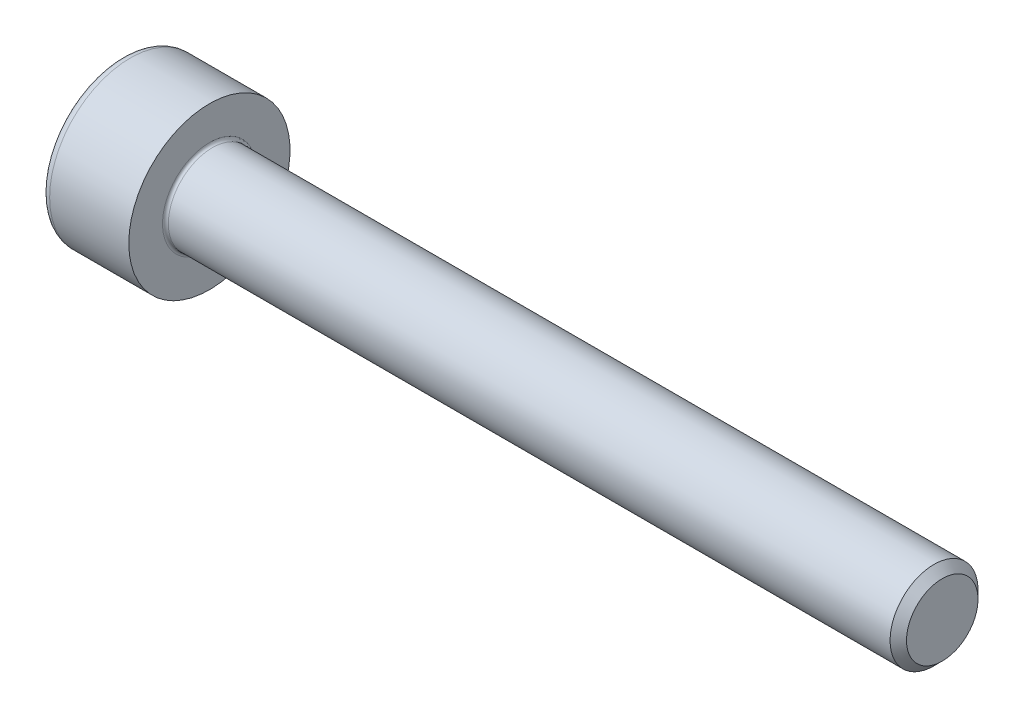
ISO-10303-21;
HEADER;
FILE_DESCRIPTION(('STEP AP214'),'2;1');
FILE_NAME('part.step','',(''),(''),'','','');
FILE_SCHEMA(('AUTOMOTIVE_DESIGN { 1 0 10303 214 1 1 1 1 }'));
ENDSEC;
DATA;
#1=APPLICATION_CONTEXT('core data for automotive mechanical design processes');
#2=APPLICATION_PROTOCOL_DEFINITION('international standard','automotive_design',2000,#1);
#3=PRODUCT_CONTEXT('',#1,'mechanical');
#4=PRODUCT('Part','Part','',(#3));
#5=PRODUCT_RELATED_PRODUCT_CATEGORY('part','',(#4));
#6=PRODUCT_DEFINITION_FORMATION('','',#4);
#7=PRODUCT_DEFINITION_CONTEXT('part definition',#1,'design');
#8=PRODUCT_DEFINITION('design','',#6,#7);
#9=PRODUCT_DEFINITION_SHAPE('','',#8);
#10=(LENGTH_UNIT() NAMED_UNIT(*) SI_UNIT(.MILLI.,.METRE.));
#11=(NAMED_UNIT(*) PLANE_ANGLE_UNIT() SI_UNIT($,.RADIAN.));
#12=(NAMED_UNIT(*) SI_UNIT($,.STERADIAN.) SOLID_ANGLE_UNIT());
#13=UNCERTAINTY_MEASURE_WITH_UNIT(LENGTH_MEASURE(1.E-05),#10,'distance_accuracy_value','');
#14=(GEOMETRIC_REPRESENTATION_CONTEXT(3) GLOBAL_UNCERTAINTY_ASSIGNED_CONTEXT((#13)) GLOBAL_UNIT_ASSIGNED_CONTEXT((#10,
#11,#12)) REPRESENTATION_CONTEXT('',''));
#15=CARTESIAN_POINT('',(0.,0.,0.));
#16=DIRECTION('',(0.,0.,1.));
#17=DIRECTION('',(1.,0.,0.));
#18=AXIS2_PLACEMENT_3D('',#15,#16,#17);
#19=CARTESIAN_POINT('',(0.,0.,0.));
#20=DIRECTION('',(-1.,0.,0.));
#21=DIRECTION('',(0.,0.,1.));
#22=AXIS2_PLACEMENT_3D('',#19,#20,#21);
#23=PLANE('',#22);
#24=DIRECTION('',(0.,-0.499999999999999,0.866025403784439));
#25=VECTOR('',#24,1.);
#26=CARTESIAN_POINT('',(0.,1.45492267835785,0.));
#27=LINE('',#26,#25);
#28=CARTESIAN_POINT('',(0.,1.45492267835785,0.));
#29=VERTEX_POINT('',#28);
#30=CARTESIAN_POINT('',(0.,0.727461339178922,1.26));
#31=VERTEX_POINT('',#30);
#32=EDGE_CURVE('E260',#29,#31,#27,.T.);
#33=ORIENTED_EDGE('',*,*,#32,.T.);
#34=DIRECTION('',(0.,1.,0.));
#35=VECTOR('',#34,1.);
#36=CARTESIAN_POINT('',(0.,-0.727461339178934,1.26));
#37=LINE('',#36,#35);
#38=CARTESIAN_POINT('',(0.,-0.727461339178934,1.26));
#39=VERTEX_POINT('',#38);
#40=EDGE_CURVE('E132',#39,#31,#37,.T.);
#41=ORIENTED_EDGE('',*,*,#40,.F.);
#42=DIRECTION('',(0.,-0.500000000000001,-0.866025403784438));
#43=VECTOR('',#42,1.);
#44=CARTESIAN_POINT('',(0.,-0.727461339178934,1.26));
#45=LINE('',#44,#43);
#46=CARTESIAN_POINT('',(0.,-1.45492267835786,0.));
#47=VERTEX_POINT('',#46);
#48=EDGE_CURVE('E263',#39,#47,#45,.T.);
#49=ORIENTED_EDGE('',*,*,#48,.T.);
#50=DIRECTION('',(0.,0.499999999999998,-0.86602540378444));
#51=VECTOR('',#50,1.);
#52=CARTESIAN_POINT('',(0.,-1.45492267835786,0.));
#53=LINE('',#52,#51);
#54=CARTESIAN_POINT('',(0.,-0.727461339178938,-1.26));
#55=VERTEX_POINT('',#54);
#56=EDGE_CURVE('E266',#47,#55,#53,.T.);
#57=ORIENTED_EDGE('',*,*,#56,.T.);
#58=DIRECTION('',(0.,-1.,0.));
#59=VECTOR('',#58,1.);
#60=CARTESIAN_POINT('',(0.,0.727461339178918,-1.26));
#61=LINE('',#60,#59);
#62=CARTESIAN_POINT('',(0.,0.727461339178918,-1.26));
#63=VERTEX_POINT('',#62);
#64=EDGE_CURVE('E269',#63,#55,#61,.T.);
#65=ORIENTED_EDGE('',*,*,#64,.F.);
#66=DIRECTION('',(0.,-0.500000000000001,-0.866025403784438));
#67=VECTOR('',#66,1.);
#68=CARTESIAN_POINT('',(0.,1.45492267835785,0.));
#69=LINE('',#68,#67);
#70=EDGE_CURVE('E127',#29,#63,#69,.T.);
#71=ORIENTED_EDGE('',*,*,#70,.F.);
#72=EDGE_LOOP('',(#33,#41,#49,#57,#65,#71));
#73=FACE_BOUND('',#72,.T.);
#74=CARTESIAN_POINT('',(0.,0.,0.));
#75=DIRECTION('',(-1.,0.,0.));
#76=DIRECTION('',(0.,0.,1.));
#77=AXIS2_PLACEMENT_3D('',#74,#75,#76);
#78=CIRCLE('',#77,2.45);
#79=CARTESIAN_POINT('',(0.,0.,2.45));
#80=VERTEX_POINT('',#79);
#81=EDGE_CURVE('E44',#80,#80,#78,.T.);
#82=ORIENTED_EDGE('',*,*,#81,.T.);
#83=EDGE_LOOP('',(#82));
#84=FACE_BOUND('',#83,.T.);
#85=ADVANCED_FACE('F36',(#73,#84),#23,.T.);
#86=CARTESIAN_POINT('',(-31.75,0.,0.));
#87=DIRECTION('',(-1.,0.,0.));
#88=DIRECTION('',(0.,0.,1.));
#89=AXIS2_PLACEMENT_3D('',#86,#87,#88);
#90=CYLINDRICAL_SURFACE('',#89,2.75);
#91=CARTESIAN_POINT('',(0.300000000000002,0.,0.));
#92=DIRECTION('',(-1.,0.,0.));
#93=DIRECTION('',(0.,0.,1.));
#94=AXIS2_PLACEMENT_3D('',#91,#92,#93);
#95=CIRCLE('',#94,2.75);
#96=CARTESIAN_POINT('',(0.300000000000002,0.,2.75));
#97=VERTEX_POINT('',#96);
#98=EDGE_CURVE('E11',#97,#97,#95,.F.);
#99=ORIENTED_EDGE('',*,*,#98,.T.);
#100=EDGE_LOOP('',(#99));
#101=FACE_BOUND('',#100,.T.);
#102=CARTESIAN_POINT('',(3.,0.,0.));
#103=DIRECTION('',(-1.,0.,0.));
#104=DIRECTION('',(0.,0.,1.));
#105=AXIS2_PLACEMENT_3D('',#102,#103,#104);
#106=CIRCLE('',#105,2.75);
#107=CARTESIAN_POINT('',(3.,0.,2.75));
#108=VERTEX_POINT('',#107);
#109=EDGE_CURVE('E150',#108,#108,#106,.T.);
#110=ORIENTED_EDGE('',*,*,#109,.T.);
#111=EDGE_LOOP('',(#110));
#112=FACE_BOUND('',#111,.T.);
#113=ADVANCED_FACE('F174',(#101,#112),#90,.T.);
#114=CARTESIAN_POINT('',(3.,2.75,0.));
#115=DIRECTION('',(1.,0.,0.));
#116=DIRECTION('',(0.,0.,-1.));
#117=AXIS2_PLACEMENT_3D('',#114,#115,#116);
#118=PLANE('',#117);
#119=CARTESIAN_POINT('',(3.,0.,0.));
#120=DIRECTION('',(1.,0.,0.));
#121=DIRECTION('',(0.,0.,-1.));
#122=AXIS2_PLACEMENT_3D('',#119,#120,#121);
#123=CIRCLE('',#122,1.59999999999995);
#124=CARTESIAN_POINT('',(3.,0.,-1.59999999999995));
#125=VERTEX_POINT('',#124);
#126=EDGE_CURVE('E153',#125,#125,#123,.F.);
#127=ORIENTED_EDGE('',*,*,#126,.T.);
#128=EDGE_LOOP('',(#127));
#129=FACE_BOUND('',#128,.T.);
#130=ORIENTED_EDGE('',*,*,#109,.F.);
#131=EDGE_LOOP('',(#130));
#132=FACE_BOUND('',#131,.T.);
#133=ADVANCED_FACE('F180',(#129,#132),#118,.T.);
#134=CARTESIAN_POINT('',(-31.75,0.,0.));
#135=DIRECTION('',(-1.,0.,0.));
#136=DIRECTION('',(0.,0.,1.));
#137=AXIS2_PLACEMENT_3D('',#134,#135,#136);
#138=CYLINDRICAL_SURFACE('',#137,1.49999999999995);
#139=CARTESIAN_POINT('',(3.1,0.,0.));
#140=DIRECTION('',(1.,0.,0.));
#141=DIRECTION('',(0.,0.,-1.));
#142=AXIS2_PLACEMENT_3D('',#139,#140,#141);
#143=CIRCLE('',#142,1.49999999999995);
#144=CARTESIAN_POINT('',(3.1,0.,-1.49999999999995));
#145=VERTEX_POINT('',#144);
#146=EDGE_CURVE('E156',#145,#145,#143,.T.);
#147=ORIENTED_EDGE('',*,*,#146,.T.);
#148=EDGE_LOOP('',(#147));
#149=FACE_BOUND('',#148,.T.);
#150=CARTESIAN_POINT('',(27.7194999999999,0.,0.));
#151=DIRECTION('',(-1.,0.,0.));
#152=DIRECTION('',(0.,0.,1.));
#153=AXIS2_PLACEMENT_3D('',#150,#151,#152);
#154=CIRCLE('',#153,1.4999999999999);
#155=CARTESIAN_POINT('',(27.7194999999999,0.,1.4999999999999));
#156=VERTEX_POINT('',#155);
#157=EDGE_CURVE('E147',#156,#156,#154,.T.);
#158=ORIENTED_EDGE('',*,*,#157,.T.);
#159=EDGE_LOOP('',(#158));
#160=FACE_BOUND('',#159,.T.);
#161=ADVANCED_FACE('F186',(#149,#160),#138,.T.);
#162=CARTESIAN_POINT('',(28.,0.,0.));
#163=DIRECTION('',(-1.,0.,0.));
#164=DIRECTION('',(0.,0.,1.));
#165=AXIS2_PLACEMENT_3D('',#162,#163,#164);
#166=CONICAL_SURFACE('',#165,1.2195,0.785398163397088);
#167=ORIENTED_EDGE('',*,*,#157,.F.);
#168=EDGE_LOOP('',(#167));
#169=FACE_BOUND('',#168,.T.);
#170=CARTESIAN_POINT('',(28.,0.,0.));
#171=DIRECTION('',(-1.,0.,0.));
#172=DIRECTION('',(0.,0.,1.));
#173=AXIS2_PLACEMENT_3D('',#170,#171,#172);
#174=CIRCLE('',#173,1.2195);
#175=CARTESIAN_POINT('',(28.,0.,1.2195));
#176=VERTEX_POINT('',#175);
#177=EDGE_CURVE('E143',#176,#176,#174,.T.);
#178=ORIENTED_EDGE('',*,*,#177,.T.);
#179=EDGE_LOOP('',(#178));
#180=FACE_BOUND('',#179,.T.);
#181=ADVANCED_FACE('F190',(#169,#180),#166,.T.);
#182=CARTESIAN_POINT('',(28.,1.2195,0.));
#183=DIRECTION('',(1.,0.,0.));
#184=DIRECTION('',(0.,0.,-1.));
#185=AXIS2_PLACEMENT_3D('',#182,#183,#184);
#186=PLANE('',#185);
#187=ORIENTED_EDGE('',*,*,#177,.F.);
#188=EDGE_LOOP('',(#187));
#189=FACE_BOUND('',#188,.T.);
#190=ADVANCED_FACE('F170',(#189),#186,.T.);
#191=CARTESIAN_POINT('',(3.1,0.,0.));
#192=DIRECTION('',(1.,0.,0.));
#193=DIRECTION('',(0.,0.,-1.));
#194=AXIS2_PLACEMENT_3D('',#191,#192,#193);
#195=TOROIDAL_SURFACE('',#194,1.59999999999995,0.1);
#196=ORIENTED_EDGE('',*,*,#146,.F.);
#197=EDGE_LOOP('',(#196));
#198=FACE_BOUND('',#197,.T.);
#199=ORIENTED_EDGE('',*,*,#126,.F.);
#200=EDGE_LOOP('',(#199));
#201=FACE_BOUND('',#200,.T.);
#202=ADVANCED_FACE('F163',(#198,#201),#195,.F.);
#203=CARTESIAN_POINT('',(0.300000000000002,0.,0.));
#204=DIRECTION('',(-1.,0.,0.));
#205=DIRECTION('',(0.,0.,1.));
#206=AXIS2_PLACEMENT_3D('',#203,#204,#205);
#207=TOROIDAL_SURFACE('',#206,2.45,0.3);
#208=ORIENTED_EDGE('',*,*,#98,.F.);
#209=EDGE_LOOP('',(#208));
#210=FACE_BOUND('',#209,.T.);
#211=ORIENTED_EDGE('',*,*,#81,.F.);
#212=EDGE_LOOP('',(#211));
#213=FACE_BOUND('',#212,.T.);
#214=ADVANCED_FACE('F38',(#210,#213),#207,.T.);
#215=CARTESIAN_POINT('',(1.3,1.45492267835785,0.));
#216=DIRECTION('',(0.,-0.866025403784439,-0.499999999999999));
#217=DIRECTION('',(0.,0.499999999999999,-0.866025403784439));
#218=AXIS2_PLACEMENT_3D('',#215,#216,#217);
#219=PLANE('',#218);
#220=ORIENTED_EDGE('',*,*,#32,.F.);
#221=DIRECTION('',(-1.,0.,0.));
#222=VECTOR('',#221,1.);
#223=CARTESIAN_POINT('',(1.3,1.45492267835785,0.));
#224=LINE('',#223,#222);
#225=CARTESIAN_POINT('',(1.3,1.45492267835785,0.));
#226=VERTEX_POINT('',#225);
#227=EDGE_CURVE('E250',#226,#29,#224,.T.);
#228=ORIENTED_EDGE('',*,*,#227,.F.);
#229=DIRECTION('',(0.,-0.499999999999999,0.866025403784439));
#230=VECTOR('',#229,1.);
#231=CARTESIAN_POINT('',(1.3,1.45492267835785,0.));
#232=LINE('',#231,#230);
#233=CARTESIAN_POINT('',(1.3,1.09119200876839,0.629999999999996));
#234=VERTEX_POINT('',#233);
#235=EDGE_CURVE('E119',#226,#234,#232,.T.);
#236=ORIENTED_EDGE('',*,*,#235,.T.);
#237=CARTESIAN_POINT('',(1.3,0.727461339178922,1.26));
#238=VERTEX_POINT('',#237);
#239=EDGE_CURVE('E110',#234,#238,#232,.T.);
#240=ORIENTED_EDGE('',*,*,#239,.T.);
#241=DIRECTION('',(-1.,0.,0.));
#242=VECTOR('',#241,1.);
#243=CARTESIAN_POINT('',(1.3,0.727461339178922,1.26));
#244=LINE('',#243,#242);
#245=EDGE_CURVE('E124',#238,#31,#244,.T.);
#246=ORIENTED_EDGE('',*,*,#245,.T.);
#247=EDGE_LOOP('',(#220,#228,#236,#240,#246));
#248=FACE_BOUND('',#247,.T.);
#249=ADVANCED_FACE('F123',(#248),#219,.T.);
#250=CARTESIAN_POINT('',(1.3,-0.727461339178934,1.26));
#251=DIRECTION('',(0.,0.,1.));
#252=DIRECTION('',(0.,-1.,0.));
#253=AXIS2_PLACEMENT_3D('',#250,#251,#252);
#254=PLANE('',#253);
#255=ORIENTED_EDGE('',*,*,#40,.T.);
#256=ORIENTED_EDGE('',*,*,#245,.F.);
#257=DIRECTION('',(0.,1.,0.));
#258=VECTOR('',#257,1.);
#259=CARTESIAN_POINT('',(1.3,-0.727461339178934,1.26));
#260=LINE('',#259,#258);
#261=CARTESIAN_POINT('',(1.3,0.,1.26));
#262=VERTEX_POINT('',#261);
#263=EDGE_CURVE('E107',#262,#238,#260,.T.);
#264=ORIENTED_EDGE('',*,*,#263,.F.);
#265=CARTESIAN_POINT('',(1.3,-0.727461339178934,1.26));
#266=VERTEX_POINT('',#265);
#267=EDGE_CURVE('E118',#266,#262,#260,.T.);
#268=ORIENTED_EDGE('',*,*,#267,.F.);
#269=DIRECTION('',(-1.,0.,0.));
#270=VECTOR('',#269,1.);
#271=CARTESIAN_POINT('',(1.3,-0.727461339178934,1.26));
#272=LINE('',#271,#270);
#273=EDGE_CURVE('E134',#266,#39,#272,.T.);
#274=ORIENTED_EDGE('',*,*,#273,.T.);
#275=EDGE_LOOP('',(#255,#256,#264,#268,#274));
#276=FACE_BOUND('',#275,.T.);
#277=ADVANCED_FACE('F129',(#276),#254,.F.);
#278=CARTESIAN_POINT('',(1.3,-0.727461339178934,1.26));
#279=DIRECTION('',(0.,0.866025403784438,-0.500000000000001));
#280=DIRECTION('',(0.,0.500000000000001,0.866025403784438));
#281=AXIS2_PLACEMENT_3D('',#278,#279,#280);
#282=PLANE('',#281);
#283=ORIENTED_EDGE('',*,*,#48,.F.);
#284=ORIENTED_EDGE('',*,*,#273,.F.);
#285=DIRECTION('',(0.,-0.500000000000001,-0.866025403784438));
#286=VECTOR('',#285,1.);
#287=CARTESIAN_POINT('',(1.3,-0.727461339178934,1.26));
#288=LINE('',#287,#286);
#289=CARTESIAN_POINT('',(1.3,-1.0911920087684,0.630000000000005));
#290=VERTEX_POINT('',#289);
#291=EDGE_CURVE('E289',#266,#290,#288,.T.);
#292=ORIENTED_EDGE('',*,*,#291,.T.);
#293=CARTESIAN_POINT('',(1.3,-1.45492267835786,0.));
#294=VERTEX_POINT('',#293);
#295=EDGE_CURVE('E278',#290,#294,#288,.T.);
#296=ORIENTED_EDGE('',*,*,#295,.T.);
#297=DIRECTION('',(-1.,0.,0.));
#298=VECTOR('',#297,1.);
#299=CARTESIAN_POINT('',(1.3,-1.45492267835786,0.));
#300=LINE('',#299,#298);
#301=EDGE_CURVE('E139',#294,#47,#300,.T.);
#302=ORIENTED_EDGE('',*,*,#301,.T.);
#303=EDGE_LOOP('',(#283,#284,#292,#296,#302));
#304=FACE_BOUND('',#303,.T.);
#305=ADVANCED_FACE('F204',(#304),#282,.T.);
#306=CARTESIAN_POINT('',(1.3,-1.45492267835786,0.));
#307=DIRECTION('',(0.,0.86602540378444,0.499999999999998));
#308=DIRECTION('',(0.,-0.499999999999998,0.86602540378444));
#309=AXIS2_PLACEMENT_3D('',#306,#307,#308);
#310=PLANE('',#309);
#311=ORIENTED_EDGE('',*,*,#56,.F.);
#312=ORIENTED_EDGE('',*,*,#301,.F.);
#313=DIRECTION('',(0.,0.499999999999998,-0.86602540378444));
#314=VECTOR('',#313,1.);
#315=CARTESIAN_POINT('',(1.3,-1.45492267835786,0.));
#316=LINE('',#315,#314);
#317=CARTESIAN_POINT('',(1.3,-1.0911920087684,-0.63));
#318=VERTEX_POINT('',#317);
#319=EDGE_CURVE('E256',#294,#318,#316,.T.);
#320=ORIENTED_EDGE('',*,*,#319,.T.);
#321=CARTESIAN_POINT('',(1.3,-0.727461339178938,-1.26));
#322=VERTEX_POINT('',#321);
#323=EDGE_CURVE('E288',#318,#322,#316,.T.);
#324=ORIENTED_EDGE('',*,*,#323,.T.);
#325=DIRECTION('',(-1.,0.,0.));
#326=VECTOR('',#325,1.);
#327=CARTESIAN_POINT('',(1.3,-0.727461339178938,-1.26));
#328=LINE('',#327,#326);
#329=EDGE_CURVE('E249',#322,#55,#328,.T.);
#330=ORIENTED_EDGE('',*,*,#329,.T.);
#331=EDGE_LOOP('',(#311,#312,#320,#324,#330));
#332=FACE_BOUND('',#331,.T.);
#333=ADVANCED_FACE('F207',(#332),#310,.T.);
#334=CARTESIAN_POINT('',(1.3,0.727461339178918,-1.26));
#335=DIRECTION('',(0.,0.,-1.));
#336=DIRECTION('',(0.,1.,0.));
#337=AXIS2_PLACEMENT_3D('',#334,#335,#336);
#338=PLANE('',#337);
#339=ORIENTED_EDGE('',*,*,#64,.T.);
#340=ORIENTED_EDGE('',*,*,#329,.F.);
#341=DIRECTION('',(0.,-1.,0.));
#342=VECTOR('',#341,1.);
#343=CARTESIAN_POINT('',(1.3,0.727461339178918,-1.26));
#344=LINE('',#343,#342);
#345=CARTESIAN_POINT('',(1.3,0.,-1.26));
#346=VERTEX_POINT('',#345);
#347=EDGE_CURVE('E253',#346,#322,#344,.T.);
#348=ORIENTED_EDGE('',*,*,#347,.F.);
#349=CARTESIAN_POINT('',(1.3,0.727461339178918,-1.26));
#350=VERTEX_POINT('',#349);
#351=EDGE_CURVE('E51',#350,#346,#344,.T.);
#352=ORIENTED_EDGE('',*,*,#351,.F.);
#353=DIRECTION('',(-1.,0.,0.));
#354=VECTOR('',#353,1.);
#355=CARTESIAN_POINT('',(1.3,0.727461339178918,-1.26));
#356=LINE('',#355,#354);
#357=EDGE_CURVE('E246',#350,#63,#356,.T.);
#358=ORIENTED_EDGE('',*,*,#357,.T.);
#359=EDGE_LOOP('',(#339,#340,#348,#352,#358));
#360=FACE_BOUND('',#359,.T.);
#361=ADVANCED_FACE('F211',(#360),#338,.F.);
#362=CARTESIAN_POINT('',(1.3,1.45492267835785,0.));
#363=DIRECTION('',(0.,0.866025403784438,-0.500000000000001));
#364=DIRECTION('',(0.,0.500000000000001,0.866025403784438));
#365=AXIS2_PLACEMENT_3D('',#362,#363,#364);
#366=PLANE('',#365);
#367=ORIENTED_EDGE('',*,*,#70,.T.);
#368=ORIENTED_EDGE('',*,*,#357,.F.);
#369=DIRECTION('',(0.,-0.500000000000001,-0.866025403784438));
#370=VECTOR('',#369,1.);
#371=CARTESIAN_POINT('',(1.3,1.45492267835785,0.));
#372=LINE('',#371,#370);
#373=CARTESIAN_POINT('',(1.3,1.09119200876838,-0.629999999999997));
#374=VERTEX_POINT('',#373);
#375=EDGE_CURVE('E236',#374,#350,#372,.T.);
#376=ORIENTED_EDGE('',*,*,#375,.F.);
#377=EDGE_CURVE('E242',#226,#374,#372,.T.);
#378=ORIENTED_EDGE('',*,*,#377,.F.);
#379=ORIENTED_EDGE('',*,*,#227,.T.);
#380=EDGE_LOOP('',(#367,#368,#376,#378,#379));
#381=FACE_BOUND('',#380,.T.);
#382=ADVANCED_FACE('F215',(#381),#366,.F.);
#383=CARTESIAN_POINT('',(1.3,2.18238401753677,-1.26));
#384=DIRECTION('',(1.,0.,0.));
#385=DIRECTION('',(0.,0.,-1.));
#386=AXIS2_PLACEMENT_3D('',#383,#384,#385);
#387=PLANE('',#386);
#388=ORIENTED_EDGE('',*,*,#347,.T.);
#389=ORIENTED_EDGE('',*,*,#323,.F.);
#390=CARTESIAN_POINT('',(1.3,0.,0.));
#391=DIRECTION('',(-1.,0.,0.));
#392=DIRECTION('',(0.,0.,1.));
#393=AXIS2_PLACEMENT_3D('',#390,#391,#392);
#394=CIRCLE('',#393,1.26);
#395=EDGE_CURVE('E284',#346,#318,#394,.T.);
#396=ORIENTED_EDGE('',*,*,#395,.F.);
#397=EDGE_LOOP('',(#388,#389,#396));
#398=FACE_BOUND('',#397,.T.);
#399=ADVANCED_FACE('F219',(#398),#387,.F.);
#400=ORIENTED_EDGE('',*,*,#319,.F.);
#401=ORIENTED_EDGE('',*,*,#295,.F.);
#402=EDGE_CURVE('E137',#318,#290,#394,.T.);
#403=ORIENTED_EDGE('',*,*,#402,.F.);
#404=EDGE_LOOP('',(#400,#401,#403));
#405=FACE_BOUND('',#404,.T.);
#406=ADVANCED_FACE('F222',(#405),#387,.F.);
#407=ORIENTED_EDGE('',*,*,#291,.F.);
#408=ORIENTED_EDGE('',*,*,#267,.T.);
#409=EDGE_CURVE('E133',#290,#262,#394,.T.);
#410=ORIENTED_EDGE('',*,*,#409,.F.);
#411=EDGE_LOOP('',(#407,#408,#410));
#412=FACE_BOUND('',#411,.T.);
#413=ADVANCED_FACE('F227',(#412),#387,.F.);
#414=ORIENTED_EDGE('',*,*,#263,.T.);
#415=ORIENTED_EDGE('',*,*,#239,.F.);
#416=EDGE_CURVE('E113',#262,#234,#394,.T.);
#417=ORIENTED_EDGE('',*,*,#416,.F.);
#418=EDGE_LOOP('',(#414,#415,#417));
#419=FACE_BOUND('',#418,.T.);
#420=ADVANCED_FACE('F109',(#419),#387,.F.);
#421=ORIENTED_EDGE('',*,*,#235,.F.);
#422=ORIENTED_EDGE('',*,*,#377,.T.);
#423=EDGE_CURVE('E144',#234,#374,#394,.T.);
#424=ORIENTED_EDGE('',*,*,#423,.F.);
#425=EDGE_LOOP('',(#421,#422,#424));
#426=FACE_BOUND('',#425,.T.);
#427=ADVANCED_FACE('F230',(#426),#387,.F.);
#428=ORIENTED_EDGE('',*,*,#375,.T.);
#429=ORIENTED_EDGE('',*,*,#351,.T.);
#430=EDGE_CURVE('E239',#374,#346,#394,.T.);
#431=ORIENTED_EDGE('',*,*,#430,.F.);
#432=EDGE_LOOP('',(#428,#429,#431));
#433=FACE_BOUND('',#432,.T.);
#434=ADVANCED_FACE('F200',(#433),#387,.F.);
#435=CARTESIAN_POINT('',(1.3,0.,0.));
#436=DIRECTION('',(-1.,0.,0.));
#437=DIRECTION('',(0.,0.,1.));
#438=AXIS2_PLACEMENT_3D('',#435,#436,#437);
#439=CONICAL_SURFACE('',#438,1.26,1.04719755119659);
#440=CARTESIAN_POINT('',(2.02746133917894,0.,0.));
#441=VERTEX_POINT('',#440);
#442=VERTEX_LOOP('',#441);
#443=FACE_BOUND('',#442,.T.);
#444=ORIENTED_EDGE('',*,*,#416,.T.);
#445=ORIENTED_EDGE('',*,*,#423,.T.);
#446=ORIENTED_EDGE('',*,*,#430,.T.);
#447=ORIENTED_EDGE('',*,*,#395,.T.);
#448=ORIENTED_EDGE('',*,*,#402,.T.);
#449=ORIENTED_EDGE('',*,*,#409,.T.);
#450=EDGE_LOOP('',(#444,#445,#446,#447,#448,#449));
#451=FACE_BOUND('',#450,.T.);
#452=ADVANCED_FACE('F198',(#443,#451),#439,.F.);
#453=CLOSED_SHELL('',(#85,#113,#133,#161,#181,#190,#202,#214,#249,#277,#305,#333,#361,#382,#399,
#406,#413,#420,#427,#434,#452));
#454=MANIFOLD_SOLID_BREP('B2',#453);
#455=ADVANCED_BREP_SHAPE_REPRESENTATION('',(#18,#454),#14);
#456=SHAPE_DEFINITION_REPRESENTATION(#9,#455);
ENDSEC;
END-ISO-10303-21;
